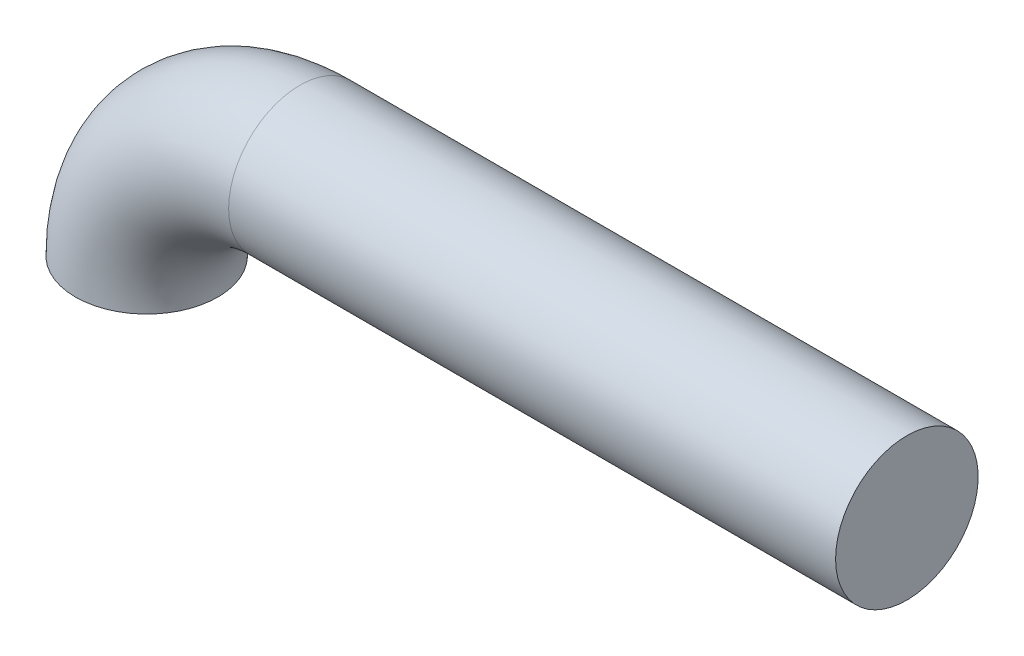
ISO-10303-21;
HEADER;
FILE_DESCRIPTION(('STEP AP214'),'2;1');
FILE_NAME('part.step','',(''),(''),'','','');
FILE_SCHEMA(('AUTOMOTIVE_DESIGN { 1 0 10303 214 1 1 1 1 }'));
ENDSEC;
DATA;
#1=APPLICATION_CONTEXT('core data for automotive mechanical design processes');
#2=APPLICATION_PROTOCOL_DEFINITION('international standard','automotive_design',2000,#1);
#3=PRODUCT_CONTEXT('',#1,'mechanical');
#4=PRODUCT('Part','Part','',(#3));
#5=PRODUCT_RELATED_PRODUCT_CATEGORY('part','',(#4));
#6=PRODUCT_DEFINITION_FORMATION('','',#4);
#7=PRODUCT_DEFINITION_CONTEXT('part definition',#1,'design');
#8=PRODUCT_DEFINITION('design','',#6,#7);
#9=PRODUCT_DEFINITION_SHAPE('','',#8);
#10=(LENGTH_UNIT() NAMED_UNIT(*) SI_UNIT(.MILLI.,.METRE.));
#11=(NAMED_UNIT(*) PLANE_ANGLE_UNIT() SI_UNIT($,.RADIAN.));
#12=(NAMED_UNIT(*) SI_UNIT($,.STERADIAN.) SOLID_ANGLE_UNIT());
#13=UNCERTAINTY_MEASURE_WITH_UNIT(LENGTH_MEASURE(1.E-05),#10,'distance_accuracy_value','');
#14=(GEOMETRIC_REPRESENTATION_CONTEXT(3) GLOBAL_UNCERTAINTY_ASSIGNED_CONTEXT((#13)) GLOBAL_UNIT_ASSIGNED_CONTEXT((#10,
#11,#12)) REPRESENTATION_CONTEXT('',''));
#15=CARTESIAN_POINT('',(0.,0.,0.));
#16=DIRECTION('',(0.,0.,1.));
#17=DIRECTION('',(1.,0.,0.));
#18=AXIS2_PLACEMENT_3D('',#15,#16,#17);
#19=CARTESIAN_POINT('',(0.,0.,0.));
#20=DIRECTION('',(0.,1.,0.));
#21=DIRECTION('',(0.,0.,1.));
#22=AXIS2_PLACEMENT_3D('',#19,#20,#21);
#23=PLANE('',#22);
#24=CARTESIAN_POINT('',(0.,0.,0.));
#25=DIRECTION('',(0.,1.,0.));
#26=DIRECTION('',(0.,0.,1.));
#27=AXIS2_PLACEMENT_3D('',#24,#25,#26);
#28=CIRCLE('',#27,60.);
#29=CARTESIAN_POINT('',(0.,0.,60.));
#30=VERTEX_POINT('',#29);
#31=EDGE_CURVE('E47',#30,#30,#28,.T.);
#32=ORIENTED_EDGE('',*,*,#31,.F.);
#33=EDGE_LOOP('',(#32));
#34=FACE_BOUND('',#33,.T.);
#35=ADVANCED_FACE('F35',(#34),#23,.F.);
#36=CARTESIAN_POINT('',(640.,129.,0.));
#37=DIRECTION('',(1.,0.,0.));
#38=DIRECTION('',(0.,0.,1.));
#39=AXIS2_PLACEMENT_3D('',#36,#37,#38);
#40=PLANE('',#39);
#41=CARTESIAN_POINT('',(640.,129.,0.));
#42=DIRECTION('',(1.,0.,0.));
#43=DIRECTION('',(0.,0.,1.));
#44=AXIS2_PLACEMENT_3D('',#41,#42,#43);
#45=CIRCLE('',#44,60.);
#46=CARTESIAN_POINT('',(640.,129.,60.));
#47=VERTEX_POINT('',#46);
#48=EDGE_CURVE('E11',#47,#47,#45,.T.);
#49=ORIENTED_EDGE('',*,*,#48,.T.);
#50=EDGE_LOOP('',(#49));
#51=FACE_BOUND('',#50,.T.);
#52=ADVANCED_FACE('F50',(#51),#40,.T.);
#53=CARTESIAN_POINT('',(129.,0.,0.));
#54=DIRECTION('',(0.,0.,-1.));
#55=DIRECTION('',(-1.,0.,0.));
#56=AXIS2_PLACEMENT_3D('',#53,#54,#55);
#57=TOROIDAL_SURFACE('',#56,129.,60.);
#58=CARTESIAN_POINT('',(129.,129.,0.));
#59=DIRECTION('',(1.,0.,0.));
#60=DIRECTION('',(0.,0.,1.));
#61=AXIS2_PLACEMENT_3D('',#58,#59,#60);
#62=CIRCLE('',#61,60.);
#63=CARTESIAN_POINT('',(129.,129.,60.));
#64=VERTEX_POINT('',#63);
#65=EDGE_CURVE('E42',#64,#64,#62,.T.);
#66=ORIENTED_EDGE('',*,*,#65,.F.);
#67=EDGE_LOOP('',(#66));
#68=FACE_BOUND('',#67,.T.);
#69=ORIENTED_EDGE('',*,*,#31,.T.);
#70=EDGE_LOOP('',(#69));
#71=FACE_BOUND('',#70,.T.);
#72=ADVANCED_FACE('F55',(#68,#71),#57,.T.);
#73=CARTESIAN_POINT('',(129.,129.,0.));
#74=DIRECTION('',(1.,0.,0.));
#75=DIRECTION('',(0.,0.,-1.));
#76=AXIS2_PLACEMENT_3D('',#73,#74,#75);
#77=CYLINDRICAL_SURFACE('',#76,60.);
#78=ORIENTED_EDGE('',*,*,#48,.F.);
#79=EDGE_LOOP('',(#78));
#80=FACE_BOUND('',#79,.T.);
#81=ORIENTED_EDGE('',*,*,#65,.T.);
#82=EDGE_LOOP('',(#81));
#83=FACE_BOUND('',#82,.T.);
#84=ADVANCED_FACE('F52',(#80,#83),#77,.T.);
#85=CLOSED_SHELL('',(#35,#52,#72,#84));
#86=MANIFOLD_SOLID_BREP('B2',#85);
#87=ADVANCED_BREP_SHAPE_REPRESENTATION('',(#18,#86),#14);
#88=SHAPE_DEFINITION_REPRESENTATION(#9,#87);
ENDSEC;
END-ISO-10303-21;
